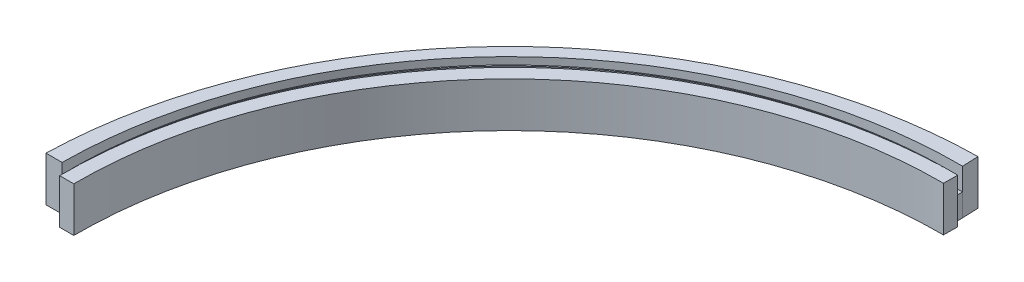
ISO-10303-21;
HEADER;
FILE_DESCRIPTION(('STEP AP214'),'2;1');
FILE_NAME('part.step','',(''),(''),'','','');
FILE_SCHEMA(('AUTOMOTIVE_DESIGN { 1 0 10303 214 1 1 1 1 }'));
ENDSEC;
DATA;
#1=APPLICATION_CONTEXT('core data for automotive mechanical design processes');
#2=APPLICATION_PROTOCOL_DEFINITION('international standard','automotive_design',2000,#1);
#3=PRODUCT_CONTEXT('',#1,'mechanical');
#4=PRODUCT('Part','Part','',(#3));
#5=PRODUCT_RELATED_PRODUCT_CATEGORY('part','',(#4));
#6=PRODUCT_DEFINITION_FORMATION('','',#4);
#7=PRODUCT_DEFINITION_CONTEXT('part definition',#1,'design');
#8=PRODUCT_DEFINITION('design','',#6,#7);
#9=PRODUCT_DEFINITION_SHAPE('','',#8);
#10=(LENGTH_UNIT() NAMED_UNIT(*) SI_UNIT(.MILLI.,.METRE.));
#11=(NAMED_UNIT(*) PLANE_ANGLE_UNIT() SI_UNIT($,.RADIAN.));
#12=(NAMED_UNIT(*) SI_UNIT($,.STERADIAN.) SOLID_ANGLE_UNIT());
#13=UNCERTAINTY_MEASURE_WITH_UNIT(LENGTH_MEASURE(1.E-05),#10,'distance_accuracy_value','');
#14=(GEOMETRIC_REPRESENTATION_CONTEXT(3) GLOBAL_UNCERTAINTY_ASSIGNED_CONTEXT((#13)) GLOBAL_UNIT_ASSIGNED_CONTEXT((#10,
#11,#12)) REPRESENTATION_CONTEXT('',''));
#15=CARTESIAN_POINT('',(0.,0.,0.));
#16=DIRECTION('',(0.,0.,1.));
#17=DIRECTION('',(1.,0.,0.));
#18=AXIS2_PLACEMENT_3D('',#15,#16,#17);
#19=CARTESIAN_POINT('',(11.6407520703495,4.77499549922325,-21.2881518990756));
#20=DIRECTION('',(0.,-1.,0.));
#21=DIRECTION('',(0.,0.,-1.));
#22=AXIS2_PLACEMENT_3D('',#19,#20,#21);
#23=PLANE('',#22);
#24=CARTESIAN_POINT('',(44.2452757143624,4.77499549922325,-21.4615925335159));
#25=DIRECTION('',(0.,-1.,0.));
#26=DIRECTION('',(-0.999985851618054,0.,0.0053194514488111));
#27=AXIS2_PLACEMENT_3D('',#24,#25,#26);
#28=CIRCLE('',#27,32.6049849517933);
#29=CARTESIAN_POINT('',(43.9788347167935,4.77499549922325,-54.0654888175719));
#30=VERTEX_POINT('',#29);
#31=CARTESIAN_POINT('',(44.357658265816,4.77499549922325,-54.0663838051802));
#32=VERTEX_POINT('',#31);
#33=EDGE_CURVE('E181',#30,#32,#28,.T.);
#34=ORIENTED_EDGE('',*,*,#33,.F.);
#35=CARTESIAN_POINT('',(43.7359618528197,4.77499549922325,-21.9702790351017));
#36=DIRECTION('',(0.,-1.,0.));
#37=DIRECTION('',(0.,0.,-1.));
#38=AXIS2_PLACEMENT_3D('',#35,#36,#37);
#39=CIRCLE('',#38,32.0961287106222);
#40=CARTESIAN_POINT('',(11.6407520703495,4.77499549922325,-22.2131518990756));
#41=VERTEX_POINT('',#40);
#42=EDGE_CURVE('E136',#41,#30,#39,.T.);
#43=ORIENTED_EDGE('',*,*,#42,.F.);
#44=CARTESIAN_POINT('',(43.9622270880753,4.77499549922325,-21.7357865478743));
#45=DIRECTION('',(0.,1.,0.));
#46=DIRECTION('',(0.000515845725088675,0.,-0.999999866951585));
#47=AXIS2_PLACEMENT_3D('',#44,#45,#46);
#48=CIRCLE('',#47,32.325);
#49=CARTESIAN_POINT('',(43.4325356062551,4.77499549922325,-54.0564463792281));
#50=VERTEX_POINT('',#49);
#51=EDGE_CURVE('E207',#50,#41,#48,.T.);
#52=ORIENTED_EDGE('',*,*,#51,.F.);
#53=CARTESIAN_POINT('',(11.6407520703495,4.77499549922325,-21.2881518990756));
#54=VERTEX_POINT('',#53);
#55=EDGE_CURVE('E182',#54,#50,#28,.T.);
#56=ORIENTED_EDGE('',*,*,#55,.F.);
#57=DIRECTION('',(-1.,0.,0.));
#58=VECTOR('',#57,1.);
#59=CARTESIAN_POINT('',(11.6407520703495,4.77499549922325,-21.2881518990756));
#60=LINE('',#59,#58);
#61=CARTESIAN_POINT('',(12.6707520703495,4.77499549922325,-21.2881518990756));
#62=VERTEX_POINT('',#61);
#63=EDGE_CURVE('E165',#62,#54,#60,.T.);
#64=ORIENTED_EDGE('',*,*,#63,.F.);
#65=CARTESIAN_POINT('',(44.2452757143624,4.77499549922325,-21.4615925335159));
#66=DIRECTION('',(0.,-1.,0.));
#67=DIRECTION('',(-0.999984913507928,0.,0.00549297337894793));
#68=AXIS2_PLACEMENT_3D('',#65,#66,#67);
#69=CIRCLE('',#68,31.575);
#70=CARTESIAN_POINT('',(44.3486291194142,4.77499549922325,-53.0364233814186));
#71=VERTEX_POINT('',#70);
#72=EDGE_CURVE('E168',#62,#71,#69,.T.);
#73=ORIENTED_EDGE('',*,*,#72,.T.);
#74=DIRECTION('',(0.00876616155515019,0.,-0.999961576467611));
#75=VECTOR('',#74,1.);
#76=CARTESIAN_POINT('',(44.357658265816,4.77499549922325,-54.0663838051802));
#77=LINE('',#76,#75);
#78=EDGE_CURVE('E172',#71,#32,#77,.T.);
#79=ORIENTED_EDGE('',*,*,#78,.T.);
#80=EDGE_LOOP('',(#34,#43,#52,#56,#64,#73,#79));
#81=FACE_BOUND('',#80,.T.);
#82=ADVANCED_FACE('F38',(#81),#23,.F.);
#83=CARTESIAN_POINT('',(44.2452757143624,1.50999549922325,-21.4615925335159));
#84=DIRECTION('',(0.,-1.,0.));
#85=DIRECTION('',(0.,0.,-1.));
#86=AXIS2_PLACEMENT_3D('',#83,#84,#85);
#87=CYLINDRICAL_SURFACE('',#86,32.6049849517933);
#88=DIRECTION('',(0.,-1.,0.));
#89=VECTOR('',#88,1.);
#90=CARTESIAN_POINT('',(43.9788347167935,1.50999549922325,-54.0654888175719));
#91=LINE('',#90,#89);
#92=CARTESIAN_POINT('',(43.9788347167935,3.14999549922325,-54.0654888175719));
#93=VERTEX_POINT('',#92);
#94=EDGE_CURVE('E131',#30,#93,#91,.T.);
#95=ORIENTED_EDGE('',*,*,#94,.F.);
#96=ORIENTED_EDGE('',*,*,#33,.T.);
#97=DIRECTION('',(0.,-1.,0.));
#98=VECTOR('',#97,1.);
#99=CARTESIAN_POINT('',(44.357658265816,1.50999549922325,-54.0663838051802));
#100=LINE('',#99,#98);
#101=CARTESIAN_POINT('',(44.357658265816,1.50999549922325,-54.0663838051802));
#102=VERTEX_POINT('',#101);
#103=EDGE_CURVE('E185',#32,#102,#100,.T.);
#104=ORIENTED_EDGE('',*,*,#103,.T.);
#105=CARTESIAN_POINT('',(44.2452757143624,1.50999549922325,-21.4615925335159));
#106=DIRECTION('',(0.,-1.,0.));
#107=DIRECTION('',(-0.999985851618054,0.,0.0053194514488111));
#108=AXIS2_PLACEMENT_3D('',#105,#106,#107);
#109=CIRCLE('',#108,32.6049849517933);
#110=CARTESIAN_POINT('',(43.9788347167935,1.50999549922325,-54.0654888175719));
#111=VERTEX_POINT('',#110);
#112=EDGE_CURVE('E156',#111,#102,#109,.T.);
#113=ORIENTED_EDGE('',*,*,#112,.F.);
#114=EDGE_CURVE('E60',#93,#111,#91,.T.);
#115=ORIENTED_EDGE('',*,*,#114,.F.);
#116=EDGE_LOOP('',(#95,#96,#104,#113,#115));
#117=FACE_BOUND('',#116,.T.);
#118=ADVANCED_FACE('F154',(#117),#87,.T.);
#119=CARTESIAN_POINT('',(11.6407520703495,1.50999549922325,-21.2881518990756));
#120=DIRECTION('',(0.,0.,-1.));
#121=DIRECTION('',(-1.,0.,0.));
#122=AXIS2_PLACEMENT_3D('',#119,#120,#121);
#123=PLANE('',#122);
#124=DIRECTION('',(0.,-1.,0.));
#125=VECTOR('',#124,1.);
#126=CARTESIAN_POINT('',(11.6407520703495,1.50999549922325,-21.2881518990756));
#127=LINE('',#126,#125);
#128=CARTESIAN_POINT('',(11.6407520703495,1.50999549922325,-21.2881518990756));
#129=VERTEX_POINT('',#128);
#130=EDGE_CURVE('E178',#54,#129,#127,.T.);
#131=ORIENTED_EDGE('',*,*,#130,.T.);
#132=DIRECTION('',(1.,0.,0.));
#133=VECTOR('',#132,1.);
#134=CARTESIAN_POINT('',(11.6407520703495,1.50999549922325,-21.2881518990756));
#135=LINE('',#134,#133);
#136=CARTESIAN_POINT('',(12.6707520703495,1.50999549922325,-21.2881518990756));
#137=VERTEX_POINT('',#136);
#138=EDGE_CURVE('E175',#129,#137,#135,.T.);
#139=ORIENTED_EDGE('',*,*,#138,.T.);
#140=DIRECTION('',(0.,1.,0.));
#141=VECTOR('',#140,1.);
#142=CARTESIAN_POINT('',(12.6707520703495,1.50999549922325,-21.2881518990756));
#143=LINE('',#142,#141);
#144=EDGE_CURVE('E139',#137,#62,#143,.T.);
#145=ORIENTED_EDGE('',*,*,#144,.T.);
#146=ORIENTED_EDGE('',*,*,#63,.T.);
#147=EDGE_LOOP('',(#131,#139,#145,#146));
#148=FACE_BOUND('',#147,.T.);
#149=ADVANCED_FACE('F40',(#148),#123,.F.);
#150=CARTESIAN_POINT('',(44.357658265816,1.50999549922325,-54.0663838051802));
#151=DIRECTION('',(0.99996157646761,0.,0.00876616155515019));
#152=DIRECTION('',(0.00876616155515019,0.,-0.999961576467611));
#153=AXIS2_PLACEMENT_3D('',#150,#151,#152);
#154=PLANE('',#153);
#155=ORIENTED_EDGE('',*,*,#103,.F.);
#156=ORIENTED_EDGE('',*,*,#78,.F.);
#157=DIRECTION('',(0.,1.,0.));
#158=VECTOR('',#157,1.);
#159=CARTESIAN_POINT('',(44.3486291194142,1.50999549922325,-53.0364233814186));
#160=LINE('',#159,#158);
#161=CARTESIAN_POINT('',(44.3486291194142,1.50999549922325,-53.0364233814186));
#162=VERTEX_POINT('',#161);
#163=EDGE_CURVE('E166',#162,#71,#160,.T.);
#164=ORIENTED_EDGE('',*,*,#163,.F.);
#165=DIRECTION('',(-0.00876616155515019,0.,0.999961576467611));
#166=VECTOR('',#165,1.);
#167=CARTESIAN_POINT('',(44.357658265816,1.50999549922325,-54.0663838051802));
#168=LINE('',#167,#166);
#169=EDGE_CURVE('E11',#102,#162,#168,.T.);
#170=ORIENTED_EDGE('',*,*,#169,.F.);
#171=EDGE_LOOP('',(#155,#156,#164,#170));
#172=FACE_BOUND('',#171,.T.);
#173=ADVANCED_FACE('F289',(#172),#154,.T.);
#174=CARTESIAN_POINT('',(44.2452757143624,1.50999549922325,-21.4615925335159));
#175=DIRECTION('',(0.,-1.,0.));
#176=DIRECTION('',(0.,0.,-1.));
#177=AXIS2_PLACEMENT_3D('',#174,#175,#176);
#178=CYLINDRICAL_SURFACE('',#177,31.575);
#179=ORIENTED_EDGE('',*,*,#72,.F.);
#180=ORIENTED_EDGE('',*,*,#144,.F.);
#181=CARTESIAN_POINT('',(44.2452757143624,1.50999549922325,-21.4615925335159));
#182=DIRECTION('',(0.,-1.,0.));
#183=DIRECTION('',(-0.999984913507928,0.,0.00549297337894794));
#184=AXIS2_PLACEMENT_3D('',#181,#182,#183);
#185=CIRCLE('',#184,31.575);
#186=EDGE_CURVE('E169',#137,#162,#185,.T.);
#187=ORIENTED_EDGE('',*,*,#186,.T.);
#188=ORIENTED_EDGE('',*,*,#163,.T.);
#189=EDGE_LOOP('',(#179,#180,#187,#188));
#190=FACE_BOUND('',#189,.T.);
#191=ADVANCED_FACE('F200',(#190),#178,.F.);
#192=DIRECTION('',(-1.,0.,0.));
#193=VECTOR('',#192,1.);
#194=CARTESIAN_POINT('',(11.6407520703495,4.77499549922325,-22.2131518990756));
#195=LINE('',#194,#193);
#196=CARTESIAN_POINT('',(10.8954591203495,4.77499549922325,-22.2131518990756));
#197=VERTEX_POINT('',#196);
#198=CARTESIAN_POINT('',(9.72075207034953,4.77499549922325,-22.2131518990756));
#199=VERTEX_POINT('',#198);
#200=EDGE_CURVE('E226',#197,#199,#195,.T.);
#201=ORIENTED_EDGE('',*,*,#200,.F.);
#202=CARTESIAN_POINT('',(43.730613089172,4.77499549922325,-21.9755521057393));
#203=DIRECTION('',(0.,1.,0.));
#204=DIRECTION('',(0.,0.,-1.));
#205=AXIS2_PLACEMENT_3D('',#202,#203,#204);
#206=CIRCLE('',#205,32.8360136103345);
#207=CARTESIAN_POINT('',(43.9682128825084,4.77499549922325,-54.8107060745618));
#208=VERTEX_POINT('',#207);
#209=EDGE_CURVE('E145',#208,#197,#206,.T.);
#210=ORIENTED_EDGE('',*,*,#209,.F.);
#211=DIRECTION('',(-0.0388154358723955,0.,-0.999246397010285));
#212=VECTOR('',#211,1.);
#213=CARTESIAN_POINT('',(43.9227988225377,4.77499549922325,-55.9798243590638));
#214=LINE('',#213,#212);
#215=CARTESIAN_POINT('',(43.9227988225377,4.77499549922325,-55.9798243590638));
#216=VERTEX_POINT('',#215);
#217=EDGE_CURVE('E232',#208,#216,#214,.T.);
#218=ORIENTED_EDGE('',*,*,#217,.T.);
#219=CARTESIAN_POINT('',(44.3736728935765,4.77499549922325,-21.3182833685092));
#220=DIRECTION('',(0.,-1.,0.));
#221=DIRECTION('',(-0.999666733517805,0.,-0.0258151486116457));
#222=AXIS2_PLACEMENT_3D('',#219,#220,#221);
#223=CIRCLE('',#222,34.6644733303109);
#224=EDGE_CURVE('E247',#199,#216,#223,.T.);
#225=ORIENTED_EDGE('',*,*,#224,.F.);
#226=EDGE_LOOP('',(#201,#210,#218,#225));
#227=FACE_BOUND('',#226,.T.);
#228=ADVANCED_FACE('F263',(#227),#23,.F.);
#229=ORIENTED_EDGE('',*,*,#55,.T.);
#230=DIRECTION('',(0.,1.,0.));
#231=VECTOR('',#230,1.);
#232=CARTESIAN_POINT('',(43.4325356062551,3.14249549922325,-54.0564463792281));
#233=LINE('',#232,#231);
#234=CARTESIAN_POINT('',(43.4325356062551,1.50999549922325,-54.0564463792281));
#235=VERTEX_POINT('',#234);
#236=EDGE_CURVE('E157',#50,#235,#233,.F.);
#237=ORIENTED_EDGE('',*,*,#236,.T.);
#238=EDGE_CURVE('E46',#129,#235,#109,.T.);
#239=ORIENTED_EDGE('',*,*,#238,.F.);
#240=ORIENTED_EDGE('',*,*,#130,.F.);
#241=EDGE_LOOP('',(#229,#237,#239,#240));
#242=FACE_BOUND('',#241,.T.);
#243=ADVANCED_FACE('F209',(#242),#87,.T.);
#244=CARTESIAN_POINT('',(11.6407520703495,1.50999549922325,-21.2881518990756));
#245=DIRECTION('',(0.,1.,0.));
#246=DIRECTION('',(0.,0.,1.));
#247=AXIS2_PLACEMENT_3D('',#244,#245,#246);
#248=PLANE('',#247);
#249=DIRECTION('',(1.,0.,0.));
#250=VECTOR('',#249,1.);
#251=CARTESIAN_POINT('',(11.6407520703495,1.50999549922325,-22.2131518990756));
#252=LINE('',#251,#250);
#253=CARTESIAN_POINT('',(9.72075207034953,1.50999549922325,-22.2131518990756));
#254=VERTEX_POINT('',#253);
#255=CARTESIAN_POINT('',(11.6407520703495,1.50999549922325,-22.2131518990756));
#256=VERTEX_POINT('',#255);
#257=EDGE_CURVE('E159',#254,#256,#252,.T.);
#258=ORIENTED_EDGE('',*,*,#257,.F.);
#259=CARTESIAN_POINT('',(44.3736728935765,1.50999549922325,-21.3182833685092));
#260=DIRECTION('',(0.,-1.,0.));
#261=DIRECTION('',(-0.999666733517805,0.,-0.0258151486116457));
#262=AXIS2_PLACEMENT_3D('',#259,#260,#261);
#263=CIRCLE('',#262,34.6644733303109);
#264=CARTESIAN_POINT('',(43.9227988225377,1.50999549922325,-55.9798243590638));
#265=VERTEX_POINT('',#264);
#266=EDGE_CURVE('E241',#254,#265,#263,.T.);
#267=ORIENTED_EDGE('',*,*,#266,.T.);
#268=DIRECTION('',(0.0388154358723955,0.,0.999246397010285));
#269=VECTOR('',#268,1.);
#270=CARTESIAN_POINT('',(43.9682128825084,1.50999549922325,-54.8107060745618));
#271=LINE('',#270,#269);
#272=CARTESIAN_POINT('',(43.9682128825084,1.50999549922325,-54.8107060745618));
#273=VERTEX_POINT('',#272);
#274=EDGE_CURVE('E240',#265,#273,#271,.T.);
#275=ORIENTED_EDGE('',*,*,#274,.T.);
#276=DIRECTION('',(0.0142518915072593,0.,0.999898436636674));
#277=VECTOR('',#276,1.);
#278=CARTESIAN_POINT('',(43.9789018011388,1.50999549922325,-54.0607822470843));
#279=LINE('',#278,#277);
#280=EDGE_CURVE('E217',#273,#111,#279,.T.);
#281=ORIENTED_EDGE('',*,*,#280,.T.);
#282=ORIENTED_EDGE('',*,*,#112,.T.);
#283=ORIENTED_EDGE('',*,*,#169,.T.);
#284=ORIENTED_EDGE('',*,*,#186,.F.);
#285=ORIENTED_EDGE('',*,*,#138,.F.);
#286=ORIENTED_EDGE('',*,*,#238,.T.);
#287=CARTESIAN_POINT('',(43.9622270880753,1.50999549922325,-21.7357865478743));
#288=DIRECTION('',(0.,1.,0.));
#289=DIRECTION('',(0.000515845725088675,0.,-0.999999866951585));
#290=AXIS2_PLACEMENT_3D('',#287,#288,#289);
#291=CIRCLE('',#290,32.325);
#292=EDGE_CURVE('E210',#235,#256,#291,.T.);
#293=ORIENTED_EDGE('',*,*,#292,.T.);
#294=EDGE_LOOP('',(#258,#267,#275,#281,#282,#283,#284,#285,#286,#293));
#295=FACE_BOUND('',#294,.T.);
#296=ADVANCED_FACE('F196',(#295),#248,.F.);
#297=CARTESIAN_POINT('',(43.9789018011388,1.50999549922325,-54.0607822470843));
#298=DIRECTION('',(-0.999898436636674,0.,0.0142518915072593));
#299=DIRECTION('',(0.0142518915072593,0.,0.999898436636674));
#300=AXIS2_PLACEMENT_3D('',#297,#298,#299);
#301=PLANE('',#300);
#302=DIRECTION('',(0.,-1.,0.));
#303=VECTOR('',#302,1.);
#304=CARTESIAN_POINT('',(43.9682128825084,1.50999549922325,-54.8107060745618));
#305=LINE('',#304,#303);
#306=CARTESIAN_POINT('',(43.9682128825084,3.14999549922325,-54.8107060745618));
#307=VERTEX_POINT('',#306);
#308=EDGE_CURVE('E149',#307,#273,#305,.T.);
#309=ORIENTED_EDGE('',*,*,#308,.F.);
#310=DIRECTION('',(-0.014251891507258,0.,-0.999898436636674));
#311=VECTOR('',#310,1.);
#312=CARTESIAN_POINT('',(43.9788347167935,3.14999549922325,-54.0654888175719));
#313=LINE('',#312,#311);
#314=EDGE_CURVE('E53',#93,#307,#313,.T.);
#315=ORIENTED_EDGE('',*,*,#314,.F.);
#316=ORIENTED_EDGE('',*,*,#114,.T.);
#317=ORIENTED_EDGE('',*,*,#280,.F.);
#318=EDGE_LOOP('',(#309,#315,#316,#317));
#319=FACE_BOUND('',#318,.T.);
#320=ADVANCED_FACE('F148',(#319),#301,.F.);
#321=CARTESIAN_POINT('',(43.9622270880753,1.50999549922325,-21.7357865478743));
#322=DIRECTION('',(0.,1.,0.));
#323=DIRECTION('',(0.,0.,1.));
#324=AXIS2_PLACEMENT_3D('',#321,#322,#323);
#325=CYLINDRICAL_SURFACE('',#324,32.325);
#326=ORIENTED_EDGE('',*,*,#236,.F.);
#327=ORIENTED_EDGE('',*,*,#51,.T.);
#328=DIRECTION('',(0.,1.,0.));
#329=VECTOR('',#328,1.);
#330=CARTESIAN_POINT('',(11.6407520703495,3.14999549922325,-22.2131518990756));
#331=LINE('',#330,#329);
#332=CARTESIAN_POINT('',(11.6407520703495,3.14999549922325,-22.2131518990756));
#333=VERTEX_POINT('',#332);
#334=EDGE_CURVE('E228',#333,#41,#331,.T.);
#335=ORIENTED_EDGE('',*,*,#334,.F.);
#336=DIRECTION('',(0.,1.,0.));
#337=VECTOR('',#336,1.);
#338=CARTESIAN_POINT('',(11.6407520703495,1.50999549922325,-22.2131518990756));
#339=LINE('',#338,#337);
#340=EDGE_CURVE('E216',#256,#333,#339,.T.);
#341=ORIENTED_EDGE('',*,*,#340,.F.);
#342=ORIENTED_EDGE('',*,*,#292,.F.);
#343=EDGE_LOOP('',(#326,#327,#335,#341,#342));
#344=FACE_BOUND('',#343,.T.);
#345=ADVANCED_FACE('F227',(#344),#325,.F.);
#346=CARTESIAN_POINT('',(11.6407520703495,1.50999549922325,-22.2131518990756));
#347=DIRECTION('',(0.,0.,1.));
#348=DIRECTION('',(1.,0.,0.));
#349=AXIS2_PLACEMENT_3D('',#346,#347,#348);
#350=PLANE('',#349);
#351=DIRECTION('',(0.,1.,0.));
#352=VECTOR('',#351,1.);
#353=CARTESIAN_POINT('',(10.8954591203495,3.14999549922325,-22.2131518990756));
#354=LINE('',#353,#352);
#355=CARTESIAN_POINT('',(10.8954591203495,3.14999549922325,-22.2131518990756));
#356=VERTEX_POINT('',#355);
#357=EDGE_CURVE('E252',#356,#197,#354,.T.);
#358=ORIENTED_EDGE('',*,*,#357,.T.);
#359=ORIENTED_EDGE('',*,*,#200,.T.);
#360=DIRECTION('',(0.,-1.,0.));
#361=VECTOR('',#360,1.);
#362=CARTESIAN_POINT('',(9.72075207034953,1.50999549922325,-22.2131518990756));
#363=LINE('',#362,#361);
#364=EDGE_CURVE('E224',#199,#254,#363,.T.);
#365=ORIENTED_EDGE('',*,*,#364,.T.);
#366=ORIENTED_EDGE('',*,*,#257,.T.);
#367=ORIENTED_EDGE('',*,*,#340,.T.);
#368=DIRECTION('',(1.,0.,0.));
#369=VECTOR('',#368,1.);
#370=CARTESIAN_POINT('',(11.6407520703495,3.14999549922325,-22.2131518990756));
#371=LINE('',#370,#369);
#372=EDGE_CURVE('E143',#356,#333,#371,.T.);
#373=ORIENTED_EDGE('',*,*,#372,.F.);
#374=EDGE_LOOP('',(#358,#359,#365,#366,#367,#373));
#375=FACE_BOUND('',#374,.T.);
#376=ADVANCED_FACE('F222',(#375),#350,.T.);
#377=CARTESIAN_POINT('',(43.9973244594127,1.50999549922325,-54.0612712768041));
#378=DIRECTION('',(0.999246397010285,0.,-0.0388154358723956));
#379=DIRECTION('',(-0.0388154358723955,0.,-0.999246397010285));
#380=AXIS2_PLACEMENT_3D('',#377,#378,#379);
#381=PLANE('',#380);
#382=EDGE_CURVE('E236',#208,#307,#305,.T.);
#383=ORIENTED_EDGE('',*,*,#382,.T.);
#384=ORIENTED_EDGE('',*,*,#308,.T.);
#385=ORIENTED_EDGE('',*,*,#274,.F.);
#386=DIRECTION('',(0.,-1.,0.));
#387=VECTOR('',#386,1.);
#388=CARTESIAN_POINT('',(43.9227988225377,1.50999549922325,-55.9798243590638));
#389=LINE('',#388,#387);
#390=EDGE_CURVE('E244',#216,#265,#389,.T.);
#391=ORIENTED_EDGE('',*,*,#390,.F.);
#392=ORIENTED_EDGE('',*,*,#217,.F.);
#393=EDGE_LOOP('',(#383,#384,#385,#391,#392));
#394=FACE_BOUND('',#393,.T.);
#395=ADVANCED_FACE('F267',(#394),#381,.T.);
#396=CARTESIAN_POINT('',(44.3736728935765,4.77499549922325,-21.3182833685092));
#397=DIRECTION('',(0.,-1.,0.));
#398=DIRECTION('',(0.,0.,-1.));
#399=AXIS2_PLACEMENT_3D('',#396,#397,#398);
#400=CYLINDRICAL_SURFACE('',#399,34.6644733303109);
#401=ORIENTED_EDGE('',*,*,#266,.F.);
#402=ORIENTED_EDGE('',*,*,#364,.F.);
#403=ORIENTED_EDGE('',*,*,#224,.T.);
#404=ORIENTED_EDGE('',*,*,#390,.T.);
#405=EDGE_LOOP('',(#401,#402,#403,#404));
#406=FACE_BOUND('',#405,.T.);
#407=ADVANCED_FACE('F266',(#406),#400,.T.);
#408=CARTESIAN_POINT('',(43.7359618528197,3.14999549922325,-21.9702790351017));
#409=DIRECTION('',(0.,1.,0.));
#410=DIRECTION('',(0.,0.,1.));
#411=AXIS2_PLACEMENT_3D('',#408,#409,#410);
#412=CYLINDRICAL_SURFACE('',#411,32.0961287106222);
#413=ORIENTED_EDGE('',*,*,#42,.T.);
#414=ORIENTED_EDGE('',*,*,#94,.T.);
#415=CARTESIAN_POINT('',(43.7359618528197,3.14999549922325,-21.9702790351017));
#416=DIRECTION('',(0.,-1.,0.));
#417=DIRECTION('',(0.,0.,-1.));
#418=AXIS2_PLACEMENT_3D('',#415,#416,#417);
#419=CIRCLE('',#418,32.0961287106222);
#420=EDGE_CURVE('E133',#333,#93,#419,.T.);
#421=ORIENTED_EDGE('',*,*,#420,.F.);
#422=ORIENTED_EDGE('',*,*,#334,.T.);
#423=EDGE_LOOP('',(#413,#414,#421,#422));
#424=FACE_BOUND('',#423,.T.);
#425=ADVANCED_FACE('F132',(#424),#412,.T.);
#426=CARTESIAN_POINT('',(43.730613089172,3.14999549922325,-21.9755521057393));
#427=DIRECTION('',(0.,1.,0.));
#428=DIRECTION('',(0.,0.,1.));
#429=AXIS2_PLACEMENT_3D('',#426,#427,#428);
#430=CYLINDRICAL_SURFACE('',#429,32.8360136103345);
#431=ORIENTED_EDGE('',*,*,#209,.T.);
#432=ORIENTED_EDGE('',*,*,#357,.F.);
#433=CARTESIAN_POINT('',(43.730613089172,3.14999549922325,-21.9755521057393));
#434=DIRECTION('',(0.,1.,0.));
#435=DIRECTION('',(0.,0.,-1.));
#436=AXIS2_PLACEMENT_3D('',#433,#434,#435);
#437=CIRCLE('',#436,32.8360136103345);
#438=EDGE_CURVE('E151',#307,#356,#437,.T.);
#439=ORIENTED_EDGE('',*,*,#438,.F.);
#440=ORIENTED_EDGE('',*,*,#382,.F.);
#441=EDGE_LOOP('',(#431,#432,#439,#440));
#442=FACE_BOUND('',#441,.T.);
#443=ADVANCED_FACE('F268',(#442),#430,.F.);
#444=CARTESIAN_POINT('',(43.7359618528197,3.14999549922325,-21.9702790351017));
#445=DIRECTION('',(0.,-1.,0.));
#446=DIRECTION('',(0.,0.,-1.));
#447=AXIS2_PLACEMENT_3D('',#444,#445,#446);
#448=PLANE('',#447);
#449=ORIENTED_EDGE('',*,*,#420,.T.);
#450=ORIENTED_EDGE('',*,*,#314,.T.);
#451=ORIENTED_EDGE('',*,*,#438,.T.);
#452=ORIENTED_EDGE('',*,*,#372,.T.);
#453=EDGE_LOOP('',(#449,#450,#451,#452));
#454=FACE_BOUND('',#453,.T.);
#455=ADVANCED_FACE('F141',(#454),#448,.F.);
#456=CLOSED_SHELL('',(#82,#118,#149,#173,#191,#228,#243,#296,#320,#345,#376,#395,#407,#425,#443,#455));
#457=MANIFOLD_SOLID_BREP('B2',#456);
#458=ADVANCED_BREP_SHAPE_REPRESENTATION('',(#18,#457),#14);
#459=SHAPE_DEFINITION_REPRESENTATION(#9,#458);
ENDSEC;
END-ISO-10303-21;
